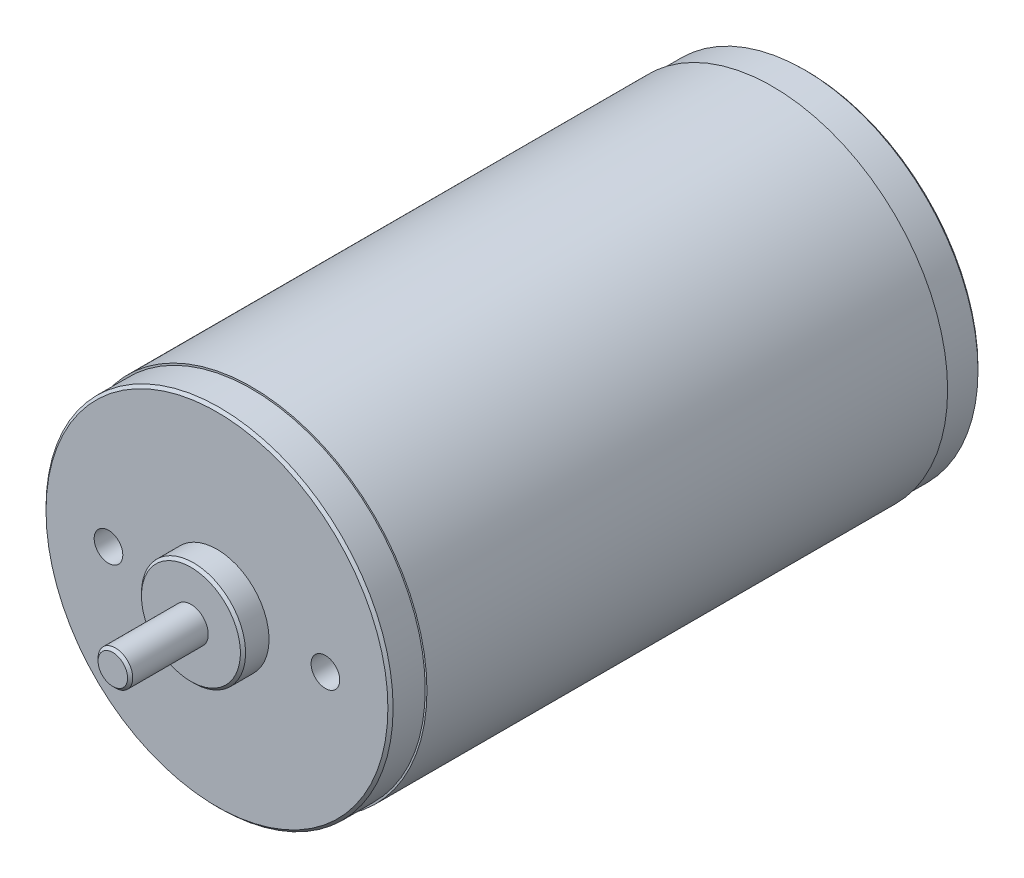
ISO-10303-21;
HEADER;
FILE_DESCRIPTION(('STEP AP214'),'2;1');
FILE_NAME('part.step','',(''),(''),'','','');
FILE_SCHEMA(('AUTOMOTIVE_DESIGN { 1 0 10303 214 1 1 1 1 }'));
ENDSEC;
DATA;
#1=APPLICATION_CONTEXT('core data for automotive mechanical design processes');
#2=APPLICATION_PROTOCOL_DEFINITION('international standard','automotive_design',2000,#1);
#3=PRODUCT_CONTEXT('',#1,'mechanical');
#4=PRODUCT('Part','Part','',(#3));
#5=PRODUCT_RELATED_PRODUCT_CATEGORY('part','',(#4));
#6=PRODUCT_DEFINITION_FORMATION('','',#4);
#7=PRODUCT_DEFINITION_CONTEXT('part definition',#1,'design');
#8=PRODUCT_DEFINITION('design','',#6,#7);
#9=PRODUCT_DEFINITION_SHAPE('','',#8);
#10=(LENGTH_UNIT() NAMED_UNIT(*) SI_UNIT(.MILLI.,.METRE.));
#11=(NAMED_UNIT(*) PLANE_ANGLE_UNIT() SI_UNIT($,.RADIAN.));
#12=(NAMED_UNIT(*) SI_UNIT($,.STERADIAN.) SOLID_ANGLE_UNIT());
#13=UNCERTAINTY_MEASURE_WITH_UNIT(LENGTH_MEASURE(1.E-05),#10,'distance_accuracy_value','');
#14=(GEOMETRIC_REPRESENTATION_CONTEXT(3) GLOBAL_UNCERTAINTY_ASSIGNED_CONTEXT((#13)) GLOBAL_UNIT_ASSIGNED_CONTEXT((#10,
#11,#12)) REPRESENTATION_CONTEXT('',''));
#15=CARTESIAN_POINT('',(0.,0.,0.));
#16=DIRECTION('',(0.,0.,1.));
#17=DIRECTION('',(1.,0.,0.));
#18=AXIS2_PLACEMENT_3D('',#15,#16,#17);
#19=CARTESIAN_POINT('',(0.,0.,12.));
#20=DIRECTION('',(0.,0.,1.));
#21=DIRECTION('',(1.,0.,0.));
#22=AXIS2_PLACEMENT_3D('',#19,#20,#21);
#23=PLANE('',#22);
#24=CARTESIAN_POINT('',(0.,0.,12.0000000000573));
#25=DIRECTION('',(0.,0.,-1.));
#26=DIRECTION('',(-1.,0.,0.));
#27=AXIS2_PLACEMENT_3D('',#24,#25,#26);
#28=CIRCLE('',#27,1.70000000002801);
#29=CARTESIAN_POINT('',(-1.70000000002801,0.,12.0000000000573));
#30=VERTEX_POINT('',#29);
#31=EDGE_CURVE('E18',#30,#30,#28,.T.);
#32=ORIENTED_EDGE('',*,*,#31,.F.);
#33=EDGE_LOOP('',(#32));
#34=FACE_BOUND('',#33,.T.);
#35=ADVANCED_FACE('F15',(#34),#23,.T.);
#36=CARTESIAN_POINT('',(0.,0.,11.7000000000758));
#37=DIRECTION('',(0.,0.,-1.));
#38=DIRECTION('',(-1.,0.,0.));
#39=AXIS2_PLACEMENT_3D('',#36,#37,#38);
#40=CONICAL_SURFACE('',#39,2.00000000000955,0.785398163397448);
#41=CARTESIAN_POINT('',(0.,0.,11.7));
#42=DIRECTION('',(0.,0.,-1.));
#43=DIRECTION('',(-1.,0.,0.));
#44=AXIS2_PLACEMENT_3D('',#41,#42,#43);
#45=CIRCLE('',#44,2.);
#46=CARTESIAN_POINT('',(-2.,0.,11.7));
#47=VERTEX_POINT('',#46);
#48=EDGE_CURVE('E51',#47,#47,#45,.T.);
#49=ORIENTED_EDGE('',*,*,#48,.F.);
#50=EDGE_LOOP('',(#49));
#51=FACE_BOUND('',#50,.T.);
#52=ORIENTED_EDGE('',*,*,#31,.T.);
#53=EDGE_LOOP('',(#52));
#54=FACE_BOUND('',#53,.T.);
#55=ADVANCED_FACE('F97',(#51,#54),#40,.T.);
#56=CARTESIAN_POINT('',(0.,0.,12.));
#57=DIRECTION('',(0.,0.,-1.));
#58=DIRECTION('',(-1.,0.,0.));
#59=AXIS2_PLACEMENT_3D('',#56,#57,#58);
#60=CYLINDRICAL_SURFACE('',#59,2.);
#61=CARTESIAN_POINT('',(0.,0.,3.));
#62=DIRECTION('',(0.,0.,-1.));
#63=DIRECTION('',(-1.,0.,0.));
#64=AXIS2_PLACEMENT_3D('',#61,#62,#63);
#65=CIRCLE('',#64,2.);
#66=CARTESIAN_POINT('',(-2.,0.,3.));
#67=VERTEX_POINT('',#66);
#68=EDGE_CURVE('E53',#67,#67,#65,.T.);
#69=ORIENTED_EDGE('',*,*,#68,.F.);
#70=EDGE_LOOP('',(#69));
#71=FACE_BOUND('',#70,.T.);
#72=ORIENTED_EDGE('',*,*,#48,.T.);
#73=EDGE_LOOP('',(#72));
#74=FACE_BOUND('',#73,.T.);
#75=ADVANCED_FACE('F93',(#71,#74),#60,.T.);
#76=CARTESIAN_POINT('',(0.,0.,-69.5));
#77=DIRECTION('',(0.,0.,-1.));
#78=DIRECTION('',(-1.,0.,0.));
#79=AXIS2_PLACEMENT_3D('',#76,#77,#78);
#80=PLANE('',#79);
#81=CARTESIAN_POINT('',(0.,0.,-69.5000000000618));
#82=DIRECTION('',(0.,0.,1.));
#83=DIRECTION('',(1.,0.,0.));
#84=AXIS2_PLACEMENT_3D('',#81,#82,#83);
#85=CIRCLE('',#84,6.02500000002237);
#86=CARTESIAN_POINT('',(6.02500000002237,0.,-69.5000000000618));
#87=VERTEX_POINT('',#86);
#88=EDGE_CURVE('E85',#87,#87,#85,.T.);
#89=ORIENTED_EDGE('',*,*,#88,.F.);
#90=EDGE_LOOP('',(#89));
#91=FACE_BOUND('',#90,.T.);
#92=ADVANCED_FACE('F96',(#91),#80,.T.);
#93=CARTESIAN_POINT('',(0.,0.,3.));
#94=DIRECTION('',(0.,0.,1.));
#95=DIRECTION('',(1.,0.,0.));
#96=AXIS2_PLACEMENT_3D('',#93,#94,#95);
#97=PLANE('',#96);
#98=ORIENTED_EDGE('',*,*,#68,.T.);
#99=EDGE_LOOP('',(#98));
#100=FACE_BOUND('',#99,.T.);
#101=CARTESIAN_POINT('',(0.,0.,2.9999999999859));
#102=DIRECTION('',(0.,0.,-1.));
#103=DIRECTION('',(-1.,0.,0.));
#104=AXIS2_PLACEMENT_3D('',#101,#102,#103);
#105=CIRCLE('',#104,5.70000000004711);
#106=CARTESIAN_POINT('',(-5.70000000004711,0.,2.9999999999859));
#107=VERTEX_POINT('',#106);
#108=EDGE_CURVE('E47',#107,#107,#105,.T.);
#109=ORIENTED_EDGE('',*,*,#108,.F.);
#110=EDGE_LOOP('',(#109));
#111=FACE_BOUND('',#110,.T.);
#112=ADVANCED_FACE('F90',(#100,#111),#97,.T.);
#113=CARTESIAN_POINT('',(0.,0.,-69.2000000000803));
#114=DIRECTION('',(0.,0.,1.));
#115=DIRECTION('',(1.,0.,0.));
#116=AXIS2_PLACEMENT_3D('',#113,#114,#115);
#117=CONICAL_SURFACE('',#116,6.32500000000391,0.785398163397448);
#118=ORIENTED_EDGE('',*,*,#88,.T.);
#119=EDGE_LOOP('',(#118));
#120=FACE_BOUND('',#119,.T.);
#121=CARTESIAN_POINT('',(0.,0.,-69.2));
#122=DIRECTION('',(0.,0.,1.));
#123=DIRECTION('',(1.,0.,0.));
#124=AXIS2_PLACEMENT_3D('',#121,#122,#123);
#125=CIRCLE('',#124,6.325);
#126=CARTESIAN_POINT('',(6.325,0.,-69.2));
#127=VERTEX_POINT('',#126);
#128=EDGE_CURVE('E41',#127,#127,#125,.T.);
#129=ORIENTED_EDGE('',*,*,#128,.F.);
#130=EDGE_LOOP('',(#129));
#131=FACE_BOUND('',#130,.T.);
#132=ADVANCED_FACE('F34',(#120,#131),#117,.T.);
#133=CARTESIAN_POINT('',(-12.5,0.,-8.10000000012678));
#134=DIRECTION('',(0.,0.,1.));
#135=DIRECTION('',(1.,0.,0.));
#136=AXIS2_PLACEMENT_3D('',#133,#134,#135);
#137=CONICAL_SURFACE('',#136,1.6499999998814,1.02974425849465);
#138=CARTESIAN_POINT('',(-12.5000000002728,0.,-9.09142002154795));
#139=VERTEX_POINT('',#138);
#140=VERTEX_LOOP('',#139);
#141=FACE_BOUND('',#140,.T.);
#142=CARTESIAN_POINT('',(-12.5,0.,-8.1));
#143=DIRECTION('',(0.,0.,1.));
#144=DIRECTION('',(1.,0.,0.));
#145=AXIS2_PLACEMENT_3D('',#142,#143,#144);
#146=CIRCLE('',#145,1.65);
#147=CARTESIAN_POINT('',(-10.85,0.,-8.1));
#148=VERTEX_POINT('',#147);
#149=EDGE_CURVE('E38',#148,#148,#146,.T.);
#150=ORIENTED_EDGE('',*,*,#149,.T.);
#151=EDGE_LOOP('',(#150));
#152=FACE_BOUND('',#151,.T.);
#153=ADVANCED_FACE('F30',(#141,#152),#137,.F.);
#154=CARTESIAN_POINT('',(12.5,0.,-8.10000000012678));
#155=DIRECTION('',(0.,0.,1.));
#156=DIRECTION('',(1.,0.,0.));
#157=AXIS2_PLACEMENT_3D('',#154,#155,#156);
#158=CONICAL_SURFACE('',#157,1.64999999985866,1.02974425848248);
#159=CARTESIAN_POINT('',(12.4999999997328,0.,-9.09142002157637));
#160=VERTEX_POINT('',#159);
#161=VERTEX_LOOP('',#160);
#162=FACE_BOUND('',#161,.T.);
#163=CARTESIAN_POINT('',(12.5,0.,-8.1));
#164=DIRECTION('',(0.,0.,1.));
#165=DIRECTION('',(1.,0.,0.));
#166=AXIS2_PLACEMENT_3D('',#163,#164,#165);
#167=CIRCLE('',#166,1.65);
#168=CARTESIAN_POINT('',(14.15,0.,-8.1));
#169=VERTEX_POINT('',#168);
#170=EDGE_CURVE('E40',#169,#169,#167,.T.);
#171=ORIENTED_EDGE('',*,*,#170,.T.);
#172=EDGE_LOOP('',(#171));
#173=FACE_BOUND('',#172,.T.);
#174=ADVANCED_FACE('F33',(#162,#173),#158,.F.);
#175=CARTESIAN_POINT('',(0.,0.,2.70000000000437));
#176=DIRECTION('',(0.,0.,-1.));
#177=DIRECTION('',(-1.,0.,0.));
#178=AXIS2_PLACEMENT_3D('',#175,#176,#177);
#179=CONICAL_SURFACE('',#178,6.00000000002865,0.785398163397448);
#180=CARTESIAN_POINT('',(0.,0.,2.70000000000002));
#181=DIRECTION('',(0.,0.,-1.));
#182=DIRECTION('',(-1.,0.,0.));
#183=AXIS2_PLACEMENT_3D('',#180,#181,#182);
#184=CIRCLE('',#183,6.);
#185=CARTESIAN_POINT('',(-6.,0.,2.70000000000002));
#186=VERTEX_POINT('',#185);
#187=EDGE_CURVE('E44',#186,#186,#184,.T.);
#188=ORIENTED_EDGE('',*,*,#187,.F.);
#189=EDGE_LOOP('',(#188));
#190=FACE_BOUND('',#189,.T.);
#191=ORIENTED_EDGE('',*,*,#108,.T.);
#192=EDGE_LOOP('',(#191));
#193=FACE_BOUND('',#192,.T.);
#194=ADVANCED_FACE('F165',(#190,#193),#179,.T.);
#195=CARTESIAN_POINT('',(0.,0.,-69.5));
#196=DIRECTION('',(0.,0.,1.));
#197=DIRECTION('',(1.,0.,0.));
#198=AXIS2_PLACEMENT_3D('',#195,#196,#197);
#199=CYLINDRICAL_SURFACE('',#198,6.325);
#200=ORIENTED_EDGE('',*,*,#128,.T.);
#201=EDGE_LOOP('',(#200));
#202=FACE_BOUND('',#201,.T.);
#203=CARTESIAN_POINT('',(0.,0.,-68.));
#204=DIRECTION('',(0.,0.,1.));
#205=DIRECTION('',(1.,0.,0.));
#206=AXIS2_PLACEMENT_3D('',#203,#204,#205);
#207=CIRCLE('',#206,6.325);
#208=CARTESIAN_POINT('',(6.325,0.,-68.));
#209=VERTEX_POINT('',#208);
#210=EDGE_CURVE('E80',#209,#209,#207,.F.);
#211=ORIENTED_EDGE('',*,*,#210,.T.);
#212=EDGE_LOOP('',(#211));
#213=FACE_BOUND('',#212,.T.);
#214=ADVANCED_FACE('F161',(#202,#213),#199,.T.);
#215=CARTESIAN_POINT('',(-12.5,0.,0.));
#216=DIRECTION('',(0.,0.,1.));
#217=DIRECTION('',(1.,0.,0.));
#218=AXIS2_PLACEMENT_3D('',#215,#216,#217);
#219=CYLINDRICAL_SURFACE('',#218,1.65);
#220=CARTESIAN_POINT('',(-12.5,0.,0.));
#221=DIRECTION('',(0.,0.,1.));
#222=DIRECTION('',(1.,0.,0.));
#223=AXIS2_PLACEMENT_3D('',#220,#221,#222);
#224=CIRCLE('',#223,1.65);
#225=CARTESIAN_POINT('',(-10.85,0.,0.));
#226=VERTEX_POINT('',#225);
#227=EDGE_CURVE('E77',#226,#226,#224,.F.);
#228=ORIENTED_EDGE('',*,*,#227,.F.);
#229=EDGE_LOOP('',(#228));
#230=FACE_BOUND('',#229,.T.);
#231=ORIENTED_EDGE('',*,*,#149,.F.);
#232=EDGE_LOOP('',(#231));
#233=FACE_BOUND('',#232,.T.);
#234=ADVANCED_FACE('F157',(#230,#233),#219,.F.);
#235=CARTESIAN_POINT('',(12.5,0.,0.));
#236=DIRECTION('',(0.,0.,1.));
#237=DIRECTION('',(1.,0.,0.));
#238=AXIS2_PLACEMENT_3D('',#235,#236,#237);
#239=CYLINDRICAL_SURFACE('',#238,1.65);
#240=CARTESIAN_POINT('',(12.5,0.,0.));
#241=DIRECTION('',(0.,0.,1.));
#242=DIRECTION('',(1.,0.,0.));
#243=AXIS2_PLACEMENT_3D('',#240,#241,#242);
#244=CIRCLE('',#243,1.65);
#245=CARTESIAN_POINT('',(14.15,0.,0.));
#246=VERTEX_POINT('',#245);
#247=EDGE_CURVE('E74',#246,#246,#244,.F.);
#248=ORIENTED_EDGE('',*,*,#247,.F.);
#249=EDGE_LOOP('',(#248));
#250=FACE_BOUND('',#249,.T.);
#251=ORIENTED_EDGE('',*,*,#170,.F.);
#252=EDGE_LOOP('',(#251));
#253=FACE_BOUND('',#252,.T.);
#254=ADVANCED_FACE('F153',(#250,#253),#239,.F.);
#255=CARTESIAN_POINT('',(0.,0.,3.));
#256=DIRECTION('',(0.,0.,-1.));
#257=DIRECTION('',(-1.,0.,0.));
#258=AXIS2_PLACEMENT_3D('',#255,#256,#257);
#259=CYLINDRICAL_SURFACE('',#258,6.);
#260=CARTESIAN_POINT('',(0.,0.,0.));
#261=DIRECTION('',(0.,0.,-1.));
#262=DIRECTION('',(-1.,0.,0.));
#263=AXIS2_PLACEMENT_3D('',#260,#261,#262);
#264=CIRCLE('',#263,6.);
#265=CARTESIAN_POINT('',(-6.,0.,0.));
#266=VERTEX_POINT('',#265);
#267=EDGE_CURVE('E71',#266,#266,#264,.T.);
#268=ORIENTED_EDGE('',*,*,#267,.F.);
#269=EDGE_LOOP('',(#268));
#270=FACE_BOUND('',#269,.T.);
#271=ORIENTED_EDGE('',*,*,#187,.T.);
#272=EDGE_LOOP('',(#271));
#273=FACE_BOUND('',#272,.T.);
#274=ADVANCED_FACE('F149',(#270,#273),#259,.T.);
#275=CARTESIAN_POINT('',(0.,0.,-68.));
#276=DIRECTION('',(0.,0.,1.));
#277=DIRECTION('',(1.,0.,0.));
#278=AXIS2_PLACEMENT_3D('',#275,#276,#277);
#279=PLANE('',#278);
#280=ORIENTED_EDGE('',*,*,#210,.F.);
#281=EDGE_LOOP('',(#280));
#282=FACE_BOUND('',#281,.T.);
#283=CARTESIAN_POINT('',(0.,0.,-68.));
#284=DIRECTION('',(0.,0.,1.));
#285=DIRECTION('',(1.,0.,0.));
#286=AXIS2_PLACEMENT_3D('',#283,#284,#285);
#287=CIRCLE('',#286,19.7);
#288=CARTESIAN_POINT('',(19.7,0.,-68.));
#289=VERTEX_POINT('',#288);
#290=EDGE_CURVE('E68',#289,#289,#287,.T.);
#291=ORIENTED_EDGE('',*,*,#290,.F.);
#292=EDGE_LOOP('',(#291));
#293=FACE_BOUND('',#292,.T.);
#294=ADVANCED_FACE('F145',(#282,#293),#279,.F.);
#295=CARTESIAN_POINT('',(0.,0.,0.));
#296=DIRECTION('',(0.,0.,1.));
#297=DIRECTION('',(1.,0.,0.));
#298=AXIS2_PLACEMENT_3D('',#295,#296,#297);
#299=PLANE('',#298);
#300=ORIENTED_EDGE('',*,*,#267,.T.);
#301=EDGE_LOOP('',(#300));
#302=FACE_BOUND('',#301,.T.);
#303=ORIENTED_EDGE('',*,*,#247,.T.);
#304=EDGE_LOOP('',(#303));
#305=FACE_BOUND('',#304,.T.);
#306=ORIENTED_EDGE('',*,*,#227,.T.);
#307=EDGE_LOOP('',(#306));
#308=FACE_BOUND('',#307,.T.);
#309=CARTESIAN_POINT('',(0.,0.,0.));
#310=DIRECTION('',(0.,0.,-1.));
#311=DIRECTION('',(-1.,0.,0.));
#312=AXIS2_PLACEMENT_3D('',#309,#310,#311);
#313=CIRCLE('',#312,19.7);
#314=CARTESIAN_POINT('',(-19.7,0.,0.));
#315=VERTEX_POINT('',#314);
#316=EDGE_CURVE('E64',#315,#315,#313,.T.);
#317=ORIENTED_EDGE('',*,*,#316,.F.);
#318=EDGE_LOOP('',(#317));
#319=FACE_BOUND('',#318,.T.);
#320=ADVANCED_FACE('F141',(#302,#305,#308,#319),#299,.T.);
#321=CARTESIAN_POINT('',(0.,0.,-67.7));
#322=DIRECTION('',(0.,0.,1.));
#323=DIRECTION('',(1.,0.,0.));
#324=AXIS2_PLACEMENT_3D('',#321,#322,#323);
#325=CONICAL_SURFACE('',#324,20.,0.785398163397466);
#326=ORIENTED_EDGE('',*,*,#290,.T.);
#327=EDGE_LOOP('',(#326));
#328=FACE_BOUND('',#327,.T.);
#329=CARTESIAN_POINT('',(0.,0.,-67.7));
#330=DIRECTION('',(0.,0.,-1.));
#331=DIRECTION('',(-1.,0.,0.));
#332=AXIS2_PLACEMENT_3D('',#329,#330,#331);
#333=CIRCLE('',#332,20.);
#334=CARTESIAN_POINT('',(-20.,0.,-67.7));
#335=VERTEX_POINT('',#334);
#336=EDGE_CURVE('E67',#335,#335,#333,.F.);
#337=ORIENTED_EDGE('',*,*,#336,.F.);
#338=EDGE_LOOP('',(#337));
#339=FACE_BOUND('',#338,.T.);
#340=ADVANCED_FACE('F137',(#328,#339),#325,.T.);
#341=CARTESIAN_POINT('',(0.,0.,-0.299999999999963));
#342=DIRECTION('',(0.,0.,-1.));
#343=DIRECTION('',(-1.,0.,0.));
#344=AXIS2_PLACEMENT_3D('',#341,#342,#343);
#345=CONICAL_SURFACE('',#344,20.,0.785398163397472);
#346=ORIENTED_EDGE('',*,*,#316,.T.);
#347=EDGE_LOOP('',(#346));
#348=FACE_BOUND('',#347,.T.);
#349=CARTESIAN_POINT('',(0.,0.,-0.299999999999964));
#350=DIRECTION('',(0.,0.,1.));
#351=DIRECTION('',(1.,0.,0.));
#352=AXIS2_PLACEMENT_3D('',#349,#350,#351);
#353=CIRCLE('',#352,20.);
#354=CARTESIAN_POINT('',(20.,0.,-0.299999999999964));
#355=VERTEX_POINT('',#354);
#356=EDGE_CURVE('E63',#355,#355,#353,.F.);
#357=ORIENTED_EDGE('',*,*,#356,.F.);
#358=EDGE_LOOP('',(#357));
#359=FACE_BOUND('',#358,.T.);
#360=ADVANCED_FACE('F133',(#348,#359),#345,.T.);
#361=CARTESIAN_POINT('',(0.,0.,-64.));
#362=DIRECTION('',(0.,0.,-1.));
#363=DIRECTION('',(-1.,0.,0.));
#364=AXIS2_PLACEMENT_3D('',#361,#362,#363);
#365=CYLINDRICAL_SURFACE('',#364,20.);
#366=CARTESIAN_POINT('',(0.,0.,-64.));
#367=DIRECTION('',(0.,0.,-1.));
#368=DIRECTION('',(-1.,0.,0.));
#369=AXIS2_PLACEMENT_3D('',#366,#367,#368);
#370=CIRCLE('',#369,20.);
#371=CARTESIAN_POINT('',(-20.,0.,-64.));
#372=VERTEX_POINT('',#371);
#373=EDGE_CURVE('E60',#372,#372,#370,.F.);
#374=ORIENTED_EDGE('',*,*,#373,.F.);
#375=EDGE_LOOP('',(#374));
#376=FACE_BOUND('',#375,.T.);
#377=ORIENTED_EDGE('',*,*,#336,.T.);
#378=EDGE_LOOP('',(#377));
#379=FACE_BOUND('',#378,.T.);
#380=ADVANCED_FACE('F129',(#376,#379),#365,.T.);
#381=CARTESIAN_POINT('',(0.,0.,-4.));
#382=DIRECTION('',(0.,0.,1.));
#383=DIRECTION('',(1.,0.,0.));
#384=AXIS2_PLACEMENT_3D('',#381,#382,#383);
#385=CYLINDRICAL_SURFACE('',#384,20.);
#386=CARTESIAN_POINT('',(0.,0.,-4.));
#387=DIRECTION('',(0.,0.,1.));
#388=DIRECTION('',(1.,0.,0.));
#389=AXIS2_PLACEMENT_3D('',#386,#387,#388);
#390=CIRCLE('',#389,20.);
#391=CARTESIAN_POINT('',(20.,0.,-4.));
#392=VERTEX_POINT('',#391);
#393=EDGE_CURVE('E57',#392,#392,#390,.F.);
#394=ORIENTED_EDGE('',*,*,#393,.F.);
#395=EDGE_LOOP('',(#394));
#396=FACE_BOUND('',#395,.T.);
#397=ORIENTED_EDGE('',*,*,#356,.T.);
#398=EDGE_LOOP('',(#397));
#399=FACE_BOUND('',#398,.T.);
#400=ADVANCED_FACE('F125',(#396,#399),#385,.T.);
#401=CARTESIAN_POINT('',(0.,0.,-64.));
#402=DIRECTION('',(0.,0.,-1.));
#403=DIRECTION('',(-1.,0.,0.));
#404=AXIS2_PLACEMENT_3D('',#401,#402,#403);
#405=PLANE('',#404);
#406=CARTESIAN_POINT('',(0.,0.,-64.));
#407=DIRECTION('',(0.,0.,1.));
#408=DIRECTION('',(1.,0.,0.));
#409=AXIS2_PLACEMENT_3D('',#406,#407,#408);
#410=CIRCLE('',#409,20.2);
#411=CARTESIAN_POINT('',(20.2,0.,-64.));
#412=VERTEX_POINT('',#411);
#413=EDGE_CURVE('E24',#412,#412,#410,.T.);
#414=ORIENTED_EDGE('',*,*,#413,.F.);
#415=EDGE_LOOP('',(#414));
#416=FACE_BOUND('',#415,.T.);
#417=ORIENTED_EDGE('',*,*,#373,.T.);
#418=EDGE_LOOP('',(#417));
#419=FACE_BOUND('',#418,.T.);
#420=ADVANCED_FACE('F118',(#416,#419),#405,.T.);
#421=CARTESIAN_POINT('',(0.,0.,-4.));
#422=DIRECTION('',(0.,0.,1.));
#423=DIRECTION('',(1.,0.,0.));
#424=AXIS2_PLACEMENT_3D('',#421,#422,#423);
#425=PLANE('',#424);
#426=CARTESIAN_POINT('',(0.,0.,-4.));
#427=DIRECTION('',(0.,0.,1.));
#428=DIRECTION('',(1.,0.,0.));
#429=AXIS2_PLACEMENT_3D('',#426,#427,#428);
#430=CIRCLE('',#429,20.2);
#431=CARTESIAN_POINT('',(20.2,0.,-4.));
#432=VERTEX_POINT('',#431);
#433=EDGE_CURVE('E10',#432,#432,#430,.F.);
#434=ORIENTED_EDGE('',*,*,#433,.F.);
#435=EDGE_LOOP('',(#434));
#436=FACE_BOUND('',#435,.T.);
#437=ORIENTED_EDGE('',*,*,#393,.T.);
#438=EDGE_LOOP('',(#437));
#439=FACE_BOUND('',#438,.T.);
#440=ADVANCED_FACE('F112',(#436,#439),#425,.T.);
#441=CARTESIAN_POINT('',(0.,0.,-68.));
#442=DIRECTION('',(0.,0.,1.));
#443=DIRECTION('',(1.,0.,0.));
#444=AXIS2_PLACEMENT_3D('',#441,#442,#443);
#445=CYLINDRICAL_SURFACE('',#444,20.2);
#446=ORIENTED_EDGE('',*,*,#433,.T.);
#447=EDGE_LOOP('',(#446));
#448=FACE_BOUND('',#447,.T.);
#449=ORIENTED_EDGE('',*,*,#413,.T.);
#450=EDGE_LOOP('',(#449));
#451=FACE_BOUND('',#450,.T.);
#452=ADVANCED_FACE('F110',(#448,#451),#445,.T.);
#453=CLOSED_SHELL('',(#35,#55,#75,#92,#112,#132,#153,#174,#194,#214,#234,#254,#274,#294,#320,
#340,#360,#380,#400,#420,#440,#452));
#454=MANIFOLD_SOLID_BREP('B1',#453);
#455=ADVANCED_BREP_SHAPE_REPRESENTATION('',(#18,#454),#14);
#456=SHAPE_DEFINITION_REPRESENTATION(#9,#455);
ENDSEC;
END-ISO-10303-21;
